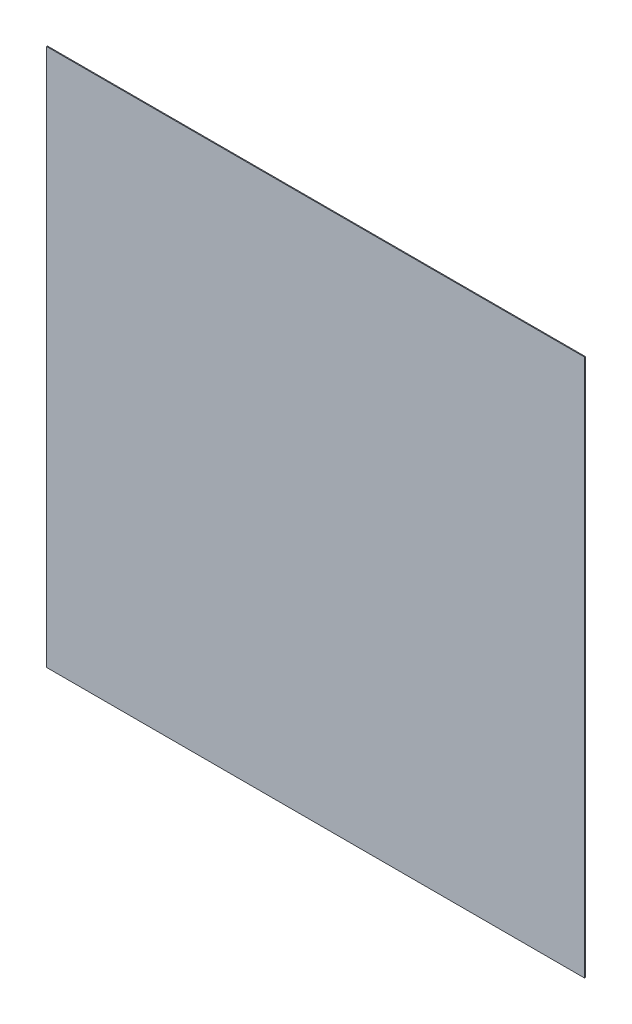
ISO-10303-21;
HEADER;
FILE_DESCRIPTION(('STEP AP214'),'2;1');
FILE_NAME('part.step','',(''),(''),'','','');
FILE_SCHEMA(('AUTOMOTIVE_DESIGN { 1 0 10303 214 1 1 1 1 }'));
ENDSEC;
DATA;
#1=APPLICATION_CONTEXT('core data for automotive mechanical design processes');
#2=APPLICATION_PROTOCOL_DEFINITION('international standard','automotive_design',2000,#1);
#3=PRODUCT_CONTEXT('',#1,'mechanical');
#4=PRODUCT('Part','Part','',(#3));
#5=PRODUCT_RELATED_PRODUCT_CATEGORY('part','',(#4));
#6=PRODUCT_DEFINITION_FORMATION('','',#4);
#7=PRODUCT_DEFINITION_CONTEXT('part definition',#1,'design');
#8=PRODUCT_DEFINITION('design','',#6,#7);
#9=PRODUCT_DEFINITION_SHAPE('','',#8);
#10=(LENGTH_UNIT() NAMED_UNIT(*) SI_UNIT(.MILLI.,.METRE.));
#11=(NAMED_UNIT(*) PLANE_ANGLE_UNIT() SI_UNIT($,.RADIAN.));
#12=(NAMED_UNIT(*) SI_UNIT($,.STERADIAN.) SOLID_ANGLE_UNIT());
#13=UNCERTAINTY_MEASURE_WITH_UNIT(LENGTH_MEASURE(1.E-05),#10,'distance_accuracy_value','');
#14=(GEOMETRIC_REPRESENTATION_CONTEXT(3) GLOBAL_UNCERTAINTY_ASSIGNED_CONTEXT((#13)) GLOBAL_UNIT_ASSIGNED_CONTEXT((#10,
#11,#12)) REPRESENTATION_CONTEXT('',''));
#15=CARTESIAN_POINT('',(0.,0.,0.));
#16=DIRECTION('',(0.,0.,1.));
#17=DIRECTION('',(1.,0.,0.));
#18=AXIS2_PLACEMENT_3D('',#15,#16,#17);
#19=CARTESIAN_POINT('',(-152.4,152.4,-0.254));
#20=DIRECTION('',(-1.,0.,0.));
#21=DIRECTION('',(0.,-1.,0.));
#22=AXIS2_PLACEMENT_3D('',#19,#20,#21);
#23=PLANE('',#22);
#24=DIRECTION('',(0.,0.,1.));
#25=VECTOR('',#24,1.);
#26=CARTESIAN_POINT('',(-152.4,-152.4,-0.254));
#27=LINE('',#26,#25);
#28=CARTESIAN_POINT('',(-152.4,-152.4,-0.254));
#29=VERTEX_POINT('',#28);
#30=CARTESIAN_POINT('',(-152.4,-152.4,0.254));
#31=VERTEX_POINT('',#30);
#32=EDGE_CURVE('E37',#29,#31,#27,.T.);
#33=ORIENTED_EDGE('',*,*,#32,.T.);
#34=DIRECTION('',(0.,-1.,0.));
#35=VECTOR('',#34,1.);
#36=CARTESIAN_POINT('',(-152.4,152.4,0.254));
#37=LINE('',#36,#35);
#38=CARTESIAN_POINT('',(-152.4,152.4,0.254));
#39=VERTEX_POINT('',#38);
#40=EDGE_CURVE('E74',#39,#31,#37,.T.);
#41=ORIENTED_EDGE('',*,*,#40,.F.);
#42=DIRECTION('',(0.,0.,1.));
#43=VECTOR('',#42,1.);
#44=CARTESIAN_POINT('',(-152.4,152.4,-0.254));
#45=LINE('',#44,#43);
#46=CARTESIAN_POINT('',(-152.4,152.4,-0.254));
#47=VERTEX_POINT('',#46);
#48=EDGE_CURVE('E11',#47,#39,#45,.T.);
#49=ORIENTED_EDGE('',*,*,#48,.F.);
#50=DIRECTION('',(0.,-1.,0.));
#51=VECTOR('',#50,1.);
#52=CARTESIAN_POINT('',(-152.4,152.4,-0.254));
#53=LINE('',#52,#51);
#54=EDGE_CURVE('E75',#47,#29,#53,.T.);
#55=ORIENTED_EDGE('',*,*,#54,.T.);
#56=EDGE_LOOP('',(#33,#41,#49,#55));
#57=FACE_BOUND('',#56,.T.);
#58=ADVANCED_FACE('F34',(#57),#23,.T.);
#59=CARTESIAN_POINT('',(-152.4,152.4,-0.254));
#60=DIRECTION('',(0.,1.,0.));
#61=DIRECTION('',(0.,0.,1.));
#62=AXIS2_PLACEMENT_3D('',#59,#60,#61);
#63=PLANE('',#62);
#64=ORIENTED_EDGE('',*,*,#48,.T.);
#65=DIRECTION('',(-1.,0.,0.));
#66=VECTOR('',#65,1.);
#67=CARTESIAN_POINT('',(-152.4,152.4,0.254));
#68=LINE('',#67,#66);
#69=CARTESIAN_POINT('',(152.4,152.4,0.254));
#70=VERTEX_POINT('',#69);
#71=EDGE_CURVE('E91',#70,#39,#68,.T.);
#72=ORIENTED_EDGE('',*,*,#71,.F.);
#73=DIRECTION('',(0.,0.,1.));
#74=VECTOR('',#73,1.);
#75=CARTESIAN_POINT('',(152.4,152.4,-0.254));
#76=LINE('',#75,#74);
#77=CARTESIAN_POINT('',(152.4,152.4,-0.254));
#78=VERTEX_POINT('',#77);
#79=EDGE_CURVE('E42',#78,#70,#76,.T.);
#80=ORIENTED_EDGE('',*,*,#79,.F.);
#81=DIRECTION('',(-1.,0.,0.));
#82=VECTOR('',#81,1.);
#83=CARTESIAN_POINT('',(-152.4,152.4,-0.254));
#84=LINE('',#83,#82);
#85=EDGE_CURVE('E80',#78,#47,#84,.T.);
#86=ORIENTED_EDGE('',*,*,#85,.T.);
#87=EDGE_LOOP('',(#64,#72,#80,#86));
#88=FACE_BOUND('',#87,.T.);
#89=ADVANCED_FACE('F106',(#88),#63,.T.);
#90=CARTESIAN_POINT('',(152.4,152.4,-0.254));
#91=DIRECTION('',(1.,0.,0.));
#92=DIRECTION('',(0.,1.,0.));
#93=AXIS2_PLACEMENT_3D('',#90,#91,#92);
#94=PLANE('',#93);
#95=ORIENTED_EDGE('',*,*,#79,.T.);
#96=DIRECTION('',(0.,1.,0.));
#97=VECTOR('',#96,1.);
#98=CARTESIAN_POINT('',(152.4,152.4,0.254));
#99=LINE('',#98,#97);
#100=CARTESIAN_POINT('',(152.4,-152.4,0.254));
#101=VERTEX_POINT('',#100);
#102=EDGE_CURVE('E87',#101,#70,#99,.T.);
#103=ORIENTED_EDGE('',*,*,#102,.F.);
#104=DIRECTION('',(0.,0.,1.));
#105=VECTOR('',#104,1.);
#106=CARTESIAN_POINT('',(152.4,-152.4,-0.254));
#107=LINE('',#106,#105);
#108=CARTESIAN_POINT('',(152.4,-152.4,-0.254));
#109=VERTEX_POINT('',#108);
#110=EDGE_CURVE('E79',#109,#101,#107,.T.);
#111=ORIENTED_EDGE('',*,*,#110,.F.);
#112=DIRECTION('',(0.,1.,0.));
#113=VECTOR('',#112,1.);
#114=CARTESIAN_POINT('',(152.4,152.4,-0.254));
#115=LINE('',#114,#113);
#116=EDGE_CURVE('E99',#109,#78,#115,.T.);
#117=ORIENTED_EDGE('',*,*,#116,.T.);
#118=EDGE_LOOP('',(#95,#103,#111,#117));
#119=FACE_BOUND('',#118,.T.);
#120=ADVANCED_FACE('F103',(#119),#94,.T.);
#121=CARTESIAN_POINT('',(-152.4,-152.4,-0.254));
#122=DIRECTION('',(0.,-1.,0.));
#123=DIRECTION('',(0.,0.,-1.));
#124=AXIS2_PLACEMENT_3D('',#121,#122,#123);
#125=PLANE('',#124);
#126=ORIENTED_EDGE('',*,*,#110,.T.);
#127=DIRECTION('',(1.,0.,0.));
#128=VECTOR('',#127,1.);
#129=CARTESIAN_POINT('',(-152.4,-152.4,0.254));
#130=LINE('',#129,#128);
#131=EDGE_CURVE('E82',#31,#101,#130,.T.);
#132=ORIENTED_EDGE('',*,*,#131,.F.);
#133=ORIENTED_EDGE('',*,*,#32,.F.);
#134=DIRECTION('',(1.,0.,0.));
#135=VECTOR('',#134,1.);
#136=CARTESIAN_POINT('',(-152.4,-152.4,-0.254));
#137=LINE('',#136,#135);
#138=EDGE_CURVE('E97',#29,#109,#137,.T.);
#139=ORIENTED_EDGE('',*,*,#138,.T.);
#140=EDGE_LOOP('',(#126,#132,#133,#139));
#141=FACE_BOUND('',#140,.T.);
#142=ADVANCED_FACE('F83',(#141),#125,.T.);
#143=CARTESIAN_POINT('',(0.,0.,-0.254));
#144=DIRECTION('',(0.,0.,1.));
#145=DIRECTION('',(1.,0.,0.));
#146=AXIS2_PLACEMENT_3D('',#143,#144,#145);
#147=PLANE('',#146);
#148=ORIENTED_EDGE('',*,*,#54,.F.);
#149=ORIENTED_EDGE('',*,*,#85,.F.);
#150=ORIENTED_EDGE('',*,*,#116,.F.);
#151=ORIENTED_EDGE('',*,*,#138,.F.);
#152=EDGE_LOOP('',(#148,#149,#150,#151));
#153=FACE_BOUND('',#152,.T.);
#154=ADVANCED_FACE('F108',(#153),#147,.F.);
#155=CARTESIAN_POINT('',(0.,0.,0.254));
#156=DIRECTION('',(0.,0.,1.));
#157=DIRECTION('',(1.,0.,0.));
#158=AXIS2_PLACEMENT_3D('',#155,#156,#157);
#159=PLANE('',#158);
#160=ORIENTED_EDGE('',*,*,#40,.T.);
#161=ORIENTED_EDGE('',*,*,#131,.T.);
#162=ORIENTED_EDGE('',*,*,#102,.T.);
#163=ORIENTED_EDGE('',*,*,#71,.T.);
#164=EDGE_LOOP('',(#160,#161,#162,#163));
#165=FACE_BOUND('',#164,.T.);
#166=ADVANCED_FACE('F90',(#165),#159,.T.);
#167=CLOSED_SHELL('',(#58,#89,#120,#142,#154,#166));
#168=MANIFOLD_SOLID_BREP('B2',#167);
#169=ADVANCED_BREP_SHAPE_REPRESENTATION('',(#18,#168),#14);
#170=SHAPE_DEFINITION_REPRESENTATION(#9,#169);
ENDSEC;
END-ISO-10303-21;
